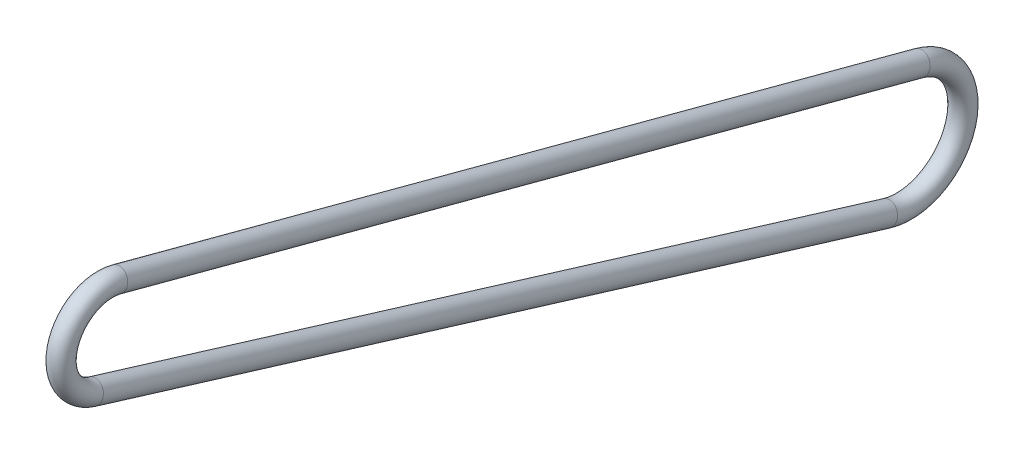
ISO-10303-21;
HEADER;
FILE_DESCRIPTION(('STEP AP214'),'2;1');
FILE_NAME('part.step','',(''),(''),'','','');
FILE_SCHEMA(('AUTOMOTIVE_DESIGN { 1 0 10303 214 1 1 1 1 }'));
ENDSEC;
DATA;
#1=APPLICATION_CONTEXT('core data for automotive mechanical design processes');
#2=APPLICATION_PROTOCOL_DEFINITION('international standard','automotive_design',2000,#1);
#3=PRODUCT_CONTEXT('',#1,'mechanical');
#4=PRODUCT('Part','Part','',(#3));
#5=PRODUCT_RELATED_PRODUCT_CATEGORY('part','',(#4));
#6=PRODUCT_DEFINITION_FORMATION('','',#4);
#7=PRODUCT_DEFINITION_CONTEXT('part definition',#1,'design');
#8=PRODUCT_DEFINITION('design','',#6,#7);
#9=PRODUCT_DEFINITION_SHAPE('','',#8);
#10=(LENGTH_UNIT() NAMED_UNIT(*) SI_UNIT(.MILLI.,.METRE.));
#11=(NAMED_UNIT(*) PLANE_ANGLE_UNIT() SI_UNIT($,.RADIAN.));
#12=(NAMED_UNIT(*) SI_UNIT($,.STERADIAN.) SOLID_ANGLE_UNIT());
#13=UNCERTAINTY_MEASURE_WITH_UNIT(LENGTH_MEASURE(1.E-05),#10,'distance_accuracy_value','');
#14=(GEOMETRIC_REPRESENTATION_CONTEXT(3) GLOBAL_UNCERTAINTY_ASSIGNED_CONTEXT((#13)) GLOBAL_UNIT_ASSIGNED_CONTEXT((#10,
#11,#12)) REPRESENTATION_CONTEXT('',''));
#15=CARTESIAN_POINT('',(0.,0.,0.));
#16=DIRECTION('',(0.,0.,1.));
#17=DIRECTION('',(1.,0.,0.));
#18=AXIS2_PLACEMENT_3D('',#15,#16,#17);
#19=CARTESIAN_POINT('',(0.,0.,0.));
#20=DIRECTION('',(-1.,0.,0.));
#21=DIRECTION('',(0.,0.,1.));
#22=AXIS2_PLACEMENT_3D('',#19,#20,#21);
#23=TOROIDAL_SURFACE('',#22,8.22007499999995,1.984375);
#24=CARTESIAN_POINT('',(0.,-7.86107837602887,2.40272340721014));
#25=DIRECTION('',(0.,0.292299450699678,0.956326843250082));
#26=DIRECTION('',(0.,-0.956326843250082,0.292299450699678));
#27=AXIS2_PLACEMENT_3D('',#24,#25,#26);
#28=CIRCLE('',#27,1.984375);
#29=CARTESIAN_POINT('',(0.,-9.75878945560325,2.98275512969231));
#30=VERTEX_POINT('',#29);
#31=EDGE_CURVE('E10',#30,#30,#28,.T.);
#32=CARTESIAN_POINT('',(0.,7.94253018782901,-2.11798187457991));
#33=DIRECTION('',(0.,-0.257659677628236,-0.96623573237824));
#34=DIRECTION('',(0.,0.96623573237824,-0.257659677628236));
#35=AXIS2_PLACEMENT_3D('',#32,#33,#34);
#36=CIRCLE('',#35,1.984375);
#37=CARTESIAN_POINT('',(0.,9.85990421926708,-2.62927529737344));
#38=VERTEX_POINT('',#37);
#39=EDGE_CURVE('E45',#38,#38,#36,.T.);
#40=CARTESIAN_POINT('',(0.,0.,0.));
#41=DIRECTION('',(-1.,0.,0.));
#42=DIRECTION('',(0.,0.,1.));
#43=AXIS2_PLACEMENT_3D('',#40,#41,#42);
#44=CIRCLE('',#43,10.2044499999999);
#45=EDGE_CURVE('',#30,#38,#44,.T.);
#46=ORIENTED_EDGE('',*,*,#31,.T.);
#47=ORIENTED_EDGE('',*,*,#39,.F.);
#48=ORIENTED_EDGE('',*,*,#45,.T.);
#49=ORIENTED_EDGE('',*,*,#45,.F.);
#50=EDGE_LOOP('',(#46,#48,#47,#49));
#51=FACE_BOUND('',#50,.T.);
#52=ADVANCED_FACE('F31',(#51),#23,.T.);
#53=CARTESIAN_POINT('',(0.,-52.9600380949838,-145.149198700929));
#54=DIRECTION('',(0.,0.292299450699678,0.956326843250082));
#55=DIRECTION('',(0.,-0.956326843250082,0.292299450699678));
#56=AXIS2_PLACEMENT_3D('',#53,#54,#55);
#57=CYLINDRICAL_SURFACE('',#56,1.984375);
#58=ORIENTED_EDGE('',*,*,#31,.F.);
#59=EDGE_LOOP('',(#58));
#60=FACE_BOUND('',#59,.T.);
#61=CARTESIAN_POINT('',(0.,-52.9600380949838,-145.149198700929));
#62=DIRECTION('',(0.,0.292299450699678,0.956326843250082));
#63=DIRECTION('',(0.,-0.956326843250082,0.292299450699678));
#64=AXIS2_PLACEMENT_3D('',#61,#62,#63);
#65=CIRCLE('',#64,1.984375);
#66=CARTESIAN_POINT('',(0.,-54.8577491745582,-144.569166978447));
#67=VERTEX_POINT('',#66);
#68=EDGE_CURVE('E37',#67,#67,#65,.T.);
#69=ORIENTED_EDGE('',*,*,#68,.T.);
#70=EDGE_LOOP('',(#69));
#71=FACE_BOUND('',#70,.T.);
#72=ADVANCED_FACE('F54',(#60,#71),#57,.T.);
#73=CARTESIAN_POINT('',(0.,-42.4404428192329,-148.364492658626));
#74=DIRECTION('',(-1.,0.,0.));
#75=DIRECTION('',(0.,0.,1.));
#76=AXIS2_PLACEMENT_3D('',#73,#74,#75);
#77=TOROIDAL_SURFACE('',#76,11.,1.984375);
#78=CARTESIAN_POINT('',(0.,-31.8118497630723,-151.198749112536));
#79=DIRECTION('',(0.,-0.257659677628236,-0.96623573237824));
#80=DIRECTION('',(0.,0.96623573237824,-0.257659677628236));
#81=AXIS2_PLACEMENT_3D('',#78,#79,#80);
#82=CIRCLE('',#81,1.984375);
#83=CARTESIAN_POINT('',(0.,-29.8944757316342,-151.71004253533));
#84=VERTEX_POINT('',#83);
#85=EDGE_CURVE('E41',#84,#84,#82,.T.);
#86=CARTESIAN_POINT('',(0.,-42.4404428192329,-148.364492658626));
#87=DIRECTION('',(-1.,0.,0.));
#88=DIRECTION('',(0.,0.,1.));
#89=AXIS2_PLACEMENT_3D('',#86,#87,#88);
#90=CIRCLE('',#89,12.984375);
#91=EDGE_CURVE('',#84,#67,#90,.T.);
#92=ORIENTED_EDGE('',*,*,#85,.T.);
#93=ORIENTED_EDGE('',*,*,#68,.F.);
#94=ORIENTED_EDGE('',*,*,#91,.T.);
#95=ORIENTED_EDGE('',*,*,#91,.F.);
#96=EDGE_LOOP('',(#92,#94,#93,#95));
#97=FACE_BOUND('',#96,.T.);
#98=ADVANCED_FACE('F58',(#97),#77,.T.);
#99=CARTESIAN_POINT('',(0.,7.94253018782901,-2.11798187457991));
#100=DIRECTION('',(0.,-0.257659677628236,-0.96623573237824));
#101=DIRECTION('',(0.,0.96623573237824,-0.257659677628236));
#102=AXIS2_PLACEMENT_3D('',#99,#100,#101);
#103=CYLINDRICAL_SURFACE('',#102,1.984375);
#104=ORIENTED_EDGE('',*,*,#85,.F.);
#105=EDGE_LOOP('',(#104));
#106=FACE_BOUND('',#105,.T.);
#107=ORIENTED_EDGE('',*,*,#39,.T.);
#108=EDGE_LOOP('',(#107));
#109=FACE_BOUND('',#108,.T.);
#110=ADVANCED_FACE('F51',(#106,#109),#103,.T.);
#111=CLOSED_SHELL('',(#52,#72,#98,#110));
#112=MANIFOLD_SOLID_BREP('B2',#111);
#113=ADVANCED_BREP_SHAPE_REPRESENTATION('',(#18,#112),#14);
#114=SHAPE_DEFINITION_REPRESENTATION(#9,#113);
ENDSEC;
END-ISO-10303-21;
